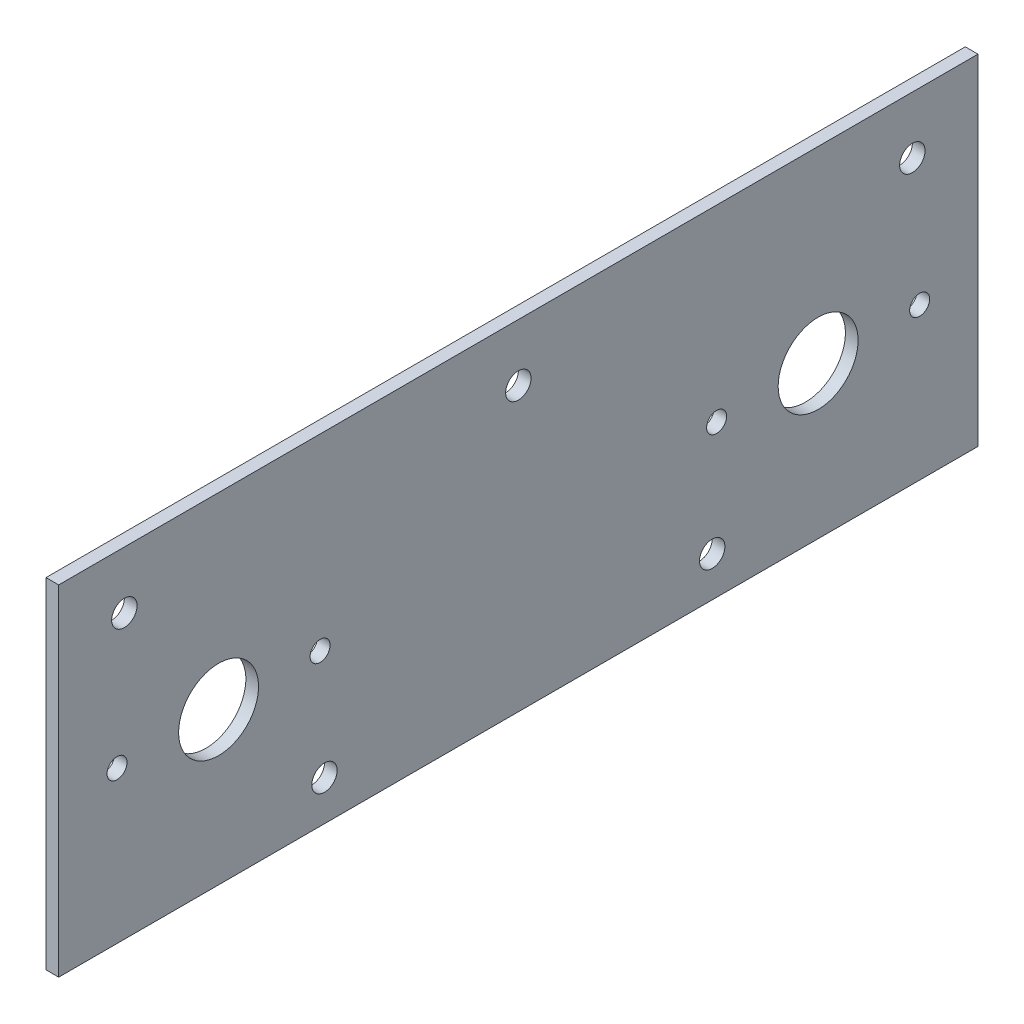
ISO-10303-21;
HEADER;
FILE_DESCRIPTION(('STEP AP214'),'2;1');
FILE_NAME('part.step','',(''),(''),'','','');
FILE_SCHEMA(('AUTOMOTIVE_DESIGN { 1 0 10303 214 1 1 1 1 }'));
ENDSEC;
DATA;
#1=APPLICATION_CONTEXT('core data for automotive mechanical design processes');
#2=APPLICATION_PROTOCOL_DEFINITION('international standard','automotive_design',2000,#1);
#3=PRODUCT_CONTEXT('',#1,'mechanical');
#4=PRODUCT('Part','Part','',(#3));
#5=PRODUCT_RELATED_PRODUCT_CATEGORY('part','',(#4));
#6=PRODUCT_DEFINITION_FORMATION('','',#4);
#7=PRODUCT_DEFINITION_CONTEXT('part definition',#1,'design');
#8=PRODUCT_DEFINITION('design','',#6,#7);
#9=PRODUCT_DEFINITION_SHAPE('','',#8);
#10=(LENGTH_UNIT() NAMED_UNIT(*) SI_UNIT(.MILLI.,.METRE.));
#11=(NAMED_UNIT(*) PLANE_ANGLE_UNIT() SI_UNIT($,.RADIAN.));
#12=(NAMED_UNIT(*) SI_UNIT($,.STERADIAN.) SOLID_ANGLE_UNIT());
#13=UNCERTAINTY_MEASURE_WITH_UNIT(LENGTH_MEASURE(1.E-05),#10,'distance_accuracy_value','');
#14=(GEOMETRIC_REPRESENTATION_CONTEXT(3) GLOBAL_UNCERTAINTY_ASSIGNED_CONTEXT((#13)) GLOBAL_UNIT_ASSIGNED_CONTEXT((#10,
#11,#12)) REPRESENTATION_CONTEXT('',''));
#15=CARTESIAN_POINT('',(0.,0.,0.));
#16=DIRECTION('',(0.,0.,1.));
#17=DIRECTION('',(1.,0.,0.));
#18=AXIS2_PLACEMENT_3D('',#15,#16,#17);
#19=CARTESIAN_POINT('',(0.,0.,0.));
#20=DIRECTION('',(1.,0.,0.));
#21=DIRECTION('',(0.,0.,-1.));
#22=AXIS2_PLACEMENT_3D('',#19,#20,#21);
#23=PLANE('',#22);
#24=CARTESIAN_POINT('',(0.,-4.49999999999999,-75.));
#25=DIRECTION('',(-1.,0.,0.));
#26=DIRECTION('',(0.,0.,1.));
#27=AXIS2_PLACEMENT_3D('',#24,#25,#26);
#28=CIRCLE('',#27,9.99999999999999);
#29=CARTESIAN_POINT('',(0.,-4.49999999999999,-65.));
#30=VERTEX_POINT('',#29);
#31=EDGE_CURVE('E112',#30,#30,#28,.F.);
#32=ORIENTED_EDGE('',*,*,#31,.T.);
#33=EDGE_LOOP('',(#32));
#34=FACE_BOUND('',#33,.T.);
#35=CARTESIAN_POINT('',(0.,-4.49999999999999,75.));
#36=DIRECTION('',(-1.,0.,0.));
#37=DIRECTION('',(0.,0.,1.));
#38=AXIS2_PLACEMENT_3D('',#35,#36,#37);
#39=CIRCLE('',#38,10.);
#40=CARTESIAN_POINT('',(0.,-4.49999999999999,85.));
#41=VERTEX_POINT('',#40);
#42=EDGE_CURVE('E116',#41,#41,#39,.F.);
#43=ORIENTED_EDGE('',*,*,#42,.T.);
#44=EDGE_LOOP('',(#43));
#45=FACE_BOUND('',#44,.T.);
#46=CARTESIAN_POINT('',(0.,-4.49999999999999,49.6));
#47=DIRECTION('',(-1.,0.,0.));
#48=DIRECTION('',(0.,0.,1.));
#49=AXIS2_PLACEMENT_3D('',#46,#47,#48);
#50=CIRCLE('',#49,2.5);
#51=CARTESIAN_POINT('',(0.,-4.49999999999999,52.1));
#52=VERTEX_POINT('',#51);
#53=EDGE_CURVE('E119',#52,#52,#50,.F.);
#54=ORIENTED_EDGE('',*,*,#53,.T.);
#55=EDGE_LOOP('',(#54));
#56=FACE_BOUND('',#55,.T.);
#57=CARTESIAN_POINT('',(0.,-4.49999999999999,-100.4));
#58=DIRECTION('',(-1.,0.,0.));
#59=DIRECTION('',(0.,0.,1.));
#60=AXIS2_PLACEMENT_3D('',#57,#58,#59);
#61=CIRCLE('',#60,2.5);
#62=CARTESIAN_POINT('',(0.,-4.49999999999999,-97.9));
#63=VERTEX_POINT('',#62);
#64=EDGE_CURVE('E122',#63,#63,#61,.F.);
#65=ORIENTED_EDGE('',*,*,#64,.T.);
#66=EDGE_LOOP('',(#65));
#67=FACE_BOUND('',#66,.T.);
#68=CARTESIAN_POINT('',(0.,-4.49999999999999,100.4));
#69=DIRECTION('',(-1.,0.,0.));
#70=DIRECTION('',(0.,0.,1.));
#71=AXIS2_PLACEMENT_3D('',#68,#69,#70);
#72=CIRCLE('',#71,2.5);
#73=CARTESIAN_POINT('',(0.,-4.49999999999999,102.9));
#74=VERTEX_POINT('',#73);
#75=EDGE_CURVE('E125',#74,#74,#72,.F.);
#76=ORIENTED_EDGE('',*,*,#75,.T.);
#77=EDGE_LOOP('',(#76));
#78=FACE_BOUND('',#77,.T.);
#79=CARTESIAN_POINT('',(0.,-4.49999999999999,-49.6));
#80=DIRECTION('',(-1.,0.,0.));
#81=DIRECTION('',(0.,0.,1.));
#82=AXIS2_PLACEMENT_3D('',#79,#80,#81);
#83=CIRCLE('',#82,2.5);
#84=CARTESIAN_POINT('',(0.,-4.49999999999999,-47.1));
#85=VERTEX_POINT('',#84);
#86=EDGE_CURVE('E128',#85,#85,#83,.F.);
#87=ORIENTED_EDGE('',*,*,#86,.T.);
#88=EDGE_LOOP('',(#87));
#89=FACE_BOUND('',#88,.T.);
#90=CARTESIAN_POINT('',(0.,28.212,98.571));
#91=DIRECTION('',(-1.,0.,0.));
#92=DIRECTION('',(0.,0.,1.));
#93=AXIS2_PLACEMENT_3D('',#90,#91,#92);
#94=CIRCLE('',#93,3.17499999999999);
#95=CARTESIAN_POINT('',(0.,28.212,101.746));
#96=VERTEX_POINT('',#95);
#97=EDGE_CURVE('E131',#96,#96,#94,.F.);
#98=ORIENTED_EDGE('',*,*,#97,.T.);
#99=EDGE_LOOP('',(#98));
#100=FACE_BOUND('',#99,.T.);
#101=CARTESIAN_POINT('',(0.,28.212,0.));
#102=DIRECTION('',(-1.,0.,0.));
#103=DIRECTION('',(0.,0.,1.));
#104=AXIS2_PLACEMENT_3D('',#101,#102,#103);
#105=CIRCLE('',#104,3.175);
#106=CARTESIAN_POINT('',(0.,28.212,3.175));
#107=VERTEX_POINT('',#106);
#108=EDGE_CURVE('E134',#107,#107,#105,.F.);
#109=ORIENTED_EDGE('',*,*,#108,.T.);
#110=EDGE_LOOP('',(#109));
#111=FACE_BOUND('',#110,.T.);
#112=CARTESIAN_POINT('',(0.,28.212,-98.571));
#113=DIRECTION('',(-1.,0.,0.));
#114=DIRECTION('',(0.,0.,1.));
#115=AXIS2_PLACEMENT_3D('',#112,#113,#114);
#116=CIRCLE('',#115,3.17499999999999);
#117=CARTESIAN_POINT('',(0.,28.212,-95.396));
#118=VERTEX_POINT('',#117);
#119=EDGE_CURVE('E137',#118,#118,#116,.F.);
#120=ORIENTED_EDGE('',*,*,#119,.T.);
#121=EDGE_LOOP('',(#120));
#122=FACE_BOUND('',#121,.T.);
#123=CARTESIAN_POINT('',(0.,-32.5,48.5));
#124=DIRECTION('',(-1.,0.,0.));
#125=DIRECTION('',(0.,0.,1.));
#126=AXIS2_PLACEMENT_3D('',#123,#124,#125);
#127=CIRCLE('',#126,3.175);
#128=CARTESIAN_POINT('',(0.,-32.5,51.675));
#129=VERTEX_POINT('',#128);
#130=EDGE_CURVE('E139',#129,#129,#127,.F.);
#131=ORIENTED_EDGE('',*,*,#130,.T.);
#132=EDGE_LOOP('',(#131));
#133=FACE_BOUND('',#132,.T.);
#134=CARTESIAN_POINT('',(0.,-32.5,-48.5));
#135=DIRECTION('',(-1.,0.,0.));
#136=DIRECTION('',(0.,0.,1.));
#137=AXIS2_PLACEMENT_3D('',#134,#135,#136);
#138=CIRCLE('',#137,3.175);
#139=CARTESIAN_POINT('',(0.,-32.5,-45.325));
#140=VERTEX_POINT('',#139);
#141=EDGE_CURVE('E20',#140,#140,#138,.F.);
#142=ORIENTED_EDGE('',*,*,#141,.T.);
#143=EDGE_LOOP('',(#142));
#144=FACE_BOUND('',#143,.T.);
#145=DIRECTION('',(0.,0.,1.));
#146=VECTOR('',#145,1.);
#147=CARTESIAN_POINT('',(0.,42.5,-115.));
#148=LINE('',#147,#146);
#149=CARTESIAN_POINT('',(0.,42.5,-115.));
#150=VERTEX_POINT('',#149);
#151=CARTESIAN_POINT('',(0.,42.5,115.));
#152=VERTEX_POINT('',#151);
#153=EDGE_CURVE('E148',#150,#152,#148,.T.);
#154=ORIENTED_EDGE('',*,*,#153,.F.);
#155=DIRECTION('',(0.,1.,0.));
#156=VECTOR('',#155,1.);
#157=CARTESIAN_POINT('',(0.,-42.5,-115.));
#158=LINE('',#157,#156);
#159=CARTESIAN_POINT('',(0.,-42.5,-115.));
#160=VERTEX_POINT('',#159);
#161=EDGE_CURVE('E55',#160,#150,#158,.T.);
#162=ORIENTED_EDGE('',*,*,#161,.F.);
#163=DIRECTION('',(0.,0.,-1.));
#164=VECTOR('',#163,1.);
#165=CARTESIAN_POINT('',(0.,-42.5,115.));
#166=LINE('',#165,#164);
#167=CARTESIAN_POINT('',(0.,-42.5,115.));
#168=VERTEX_POINT('',#167);
#169=EDGE_CURVE('E57',#168,#160,#166,.T.);
#170=ORIENTED_EDGE('',*,*,#169,.F.);
#171=DIRECTION('',(0.,1.,0.));
#172=VECTOR('',#171,1.);
#173=CARTESIAN_POINT('',(0.,42.5,115.));
#174=LINE('',#173,#172);
#175=EDGE_CURVE('E59',#152,#168,#174,.F.);
#176=ORIENTED_EDGE('',*,*,#175,.F.);
#177=EDGE_LOOP('',(#154,#162,#170,#176));
#178=FACE_BOUND('',#177,.T.);
#179=ADVANCED_FACE('F17',(#34,#45,#56,#67,#78,#89,#100,#111,#122,#133,#144,#178),#23,.F.);
#180=CARTESIAN_POINT('',(0.,42.5,115.));
#181=DIRECTION('',(0.,0.,1.));
#182=DIRECTION('',(1.,0.,0.));
#183=AXIS2_PLACEMENT_3D('',#180,#181,#182);
#184=PLANE('',#183);
#185=DIRECTION('',(0.,1.,0.));
#186=VECTOR('',#185,1.);
#187=CARTESIAN_POINT('',(3.175,0.,115.));
#188=LINE('',#187,#186);
#189=CARTESIAN_POINT('',(3.175,42.5,115.));
#190=VERTEX_POINT('',#189);
#191=CARTESIAN_POINT('',(3.175,-42.5,115.));
#192=VERTEX_POINT('',#191);
#193=EDGE_CURVE('E115',#190,#192,#188,.F.);
#194=ORIENTED_EDGE('',*,*,#193,.F.);
#195=DIRECTION('',(1.,0.,0.));
#196=VECTOR('',#195,1.);
#197=CARTESIAN_POINT('',(0.,42.5,115.));
#198=LINE('',#197,#196);
#199=EDGE_CURVE('E70',#152,#190,#198,.T.);
#200=ORIENTED_EDGE('',*,*,#199,.F.);
#201=ORIENTED_EDGE('',*,*,#175,.T.);
#202=DIRECTION('',(1.,0.,0.));
#203=VECTOR('',#202,1.);
#204=CARTESIAN_POINT('',(0.,-42.5,115.));
#205=LINE('',#204,#203);
#206=EDGE_CURVE('E64',#192,#168,#205,.F.);
#207=ORIENTED_EDGE('',*,*,#206,.F.);
#208=EDGE_LOOP('',(#194,#200,#201,#207));
#209=FACE_BOUND('',#208,.T.);
#210=ADVANCED_FACE('F67',(#209),#184,.T.);
#211=CARTESIAN_POINT('',(0.,-42.5,115.));
#212=DIRECTION('',(0.,-1.,0.));
#213=DIRECTION('',(0.,0.,-1.));
#214=AXIS2_PLACEMENT_3D('',#211,#212,#213);
#215=PLANE('',#214);
#216=DIRECTION('',(0.,0.,-1.));
#217=VECTOR('',#216,1.);
#218=CARTESIAN_POINT('',(3.175,-42.5,0.));
#219=LINE('',#218,#217);
#220=CARTESIAN_POINT('',(3.175,-42.5,-115.));
#221=VERTEX_POINT('',#220);
#222=EDGE_CURVE('E75',#192,#221,#219,.T.);
#223=ORIENTED_EDGE('',*,*,#222,.F.);
#224=ORIENTED_EDGE('',*,*,#206,.T.);
#225=ORIENTED_EDGE('',*,*,#169,.T.);
#226=DIRECTION('',(-1.,0.,0.));
#227=VECTOR('',#226,1.);
#228=CARTESIAN_POINT('',(0.,-42.5,-115.));
#229=LINE('',#228,#227);
#230=EDGE_CURVE('E78',#221,#160,#229,.T.);
#231=ORIENTED_EDGE('',*,*,#230,.F.);
#232=EDGE_LOOP('',(#223,#224,#225,#231));
#233=FACE_BOUND('',#232,.T.);
#234=ADVANCED_FACE('F73',(#233),#215,.T.);
#235=CARTESIAN_POINT('',(0.,-42.5,-115.));
#236=DIRECTION('',(0.,0.,-1.));
#237=DIRECTION('',(-1.,0.,0.));
#238=AXIS2_PLACEMENT_3D('',#235,#236,#237);
#239=PLANE('',#238);
#240=DIRECTION('',(0.,1.,0.));
#241=VECTOR('',#240,1.);
#242=CARTESIAN_POINT('',(3.175,0.,-115.));
#243=LINE('',#242,#241);
#244=CARTESIAN_POINT('',(3.175,42.5,-115.));
#245=VERTEX_POINT('',#244);
#246=EDGE_CURVE('E155',#221,#245,#243,.T.);
#247=ORIENTED_EDGE('',*,*,#246,.F.);
#248=ORIENTED_EDGE('',*,*,#230,.T.);
#249=ORIENTED_EDGE('',*,*,#161,.T.);
#250=DIRECTION('',(1.,0.,0.));
#251=VECTOR('',#250,1.);
#252=CARTESIAN_POINT('',(0.,42.5,-115.));
#253=LINE('',#252,#251);
#254=EDGE_CURVE('E35',#245,#150,#253,.F.);
#255=ORIENTED_EDGE('',*,*,#254,.F.);
#256=EDGE_LOOP('',(#247,#248,#249,#255));
#257=FACE_BOUND('',#256,.T.);
#258=ADVANCED_FACE('F153',(#257),#239,.T.);
#259=CARTESIAN_POINT('',(0.,42.5,-115.));
#260=DIRECTION('',(0.,1.,0.));
#261=DIRECTION('',(0.,0.,1.));
#262=AXIS2_PLACEMENT_3D('',#259,#260,#261);
#263=PLANE('',#262);
#264=DIRECTION('',(0.,0.,-1.));
#265=VECTOR('',#264,1.);
#266=CARTESIAN_POINT('',(3.175,42.5,0.));
#267=LINE('',#266,#265);
#268=EDGE_CURVE('E111',#245,#190,#267,.F.);
#269=ORIENTED_EDGE('',*,*,#268,.F.);
#270=ORIENTED_EDGE('',*,*,#254,.T.);
#271=ORIENTED_EDGE('',*,*,#153,.T.);
#272=ORIENTED_EDGE('',*,*,#199,.T.);
#273=EDGE_LOOP('',(#269,#270,#271,#272));
#274=FACE_BOUND('',#273,.T.);
#275=ADVANCED_FACE('F161',(#274),#263,.T.);
#276=CARTESIAN_POINT('',(3.175,-32.5,-48.5));
#277=DIRECTION('',(-1.,0.,0.));
#278=DIRECTION('',(0.,0.,1.));
#279=AXIS2_PLACEMENT_3D('',#276,#277,#278);
#280=CYLINDRICAL_SURFACE('',#279,3.175);
#281=ORIENTED_EDGE('',*,*,#141,.F.);
#282=EDGE_LOOP('',(#281));
#283=FACE_BOUND('',#282,.T.);
#284=CARTESIAN_POINT('',(3.175,-32.5,-48.5));
#285=DIRECTION('',(-1.,0.,0.));
#286=DIRECTION('',(0.,0.,1.));
#287=AXIS2_PLACEMENT_3D('',#284,#285,#286);
#288=CIRCLE('',#287,3.175);
#289=CARTESIAN_POINT('',(3.175,-32.5,-45.325));
#290=VERTEX_POINT('',#289);
#291=EDGE_CURVE('E108',#290,#290,#288,.T.);
#292=ORIENTED_EDGE('',*,*,#291,.F.);
#293=EDGE_LOOP('',(#292));
#294=FACE_BOUND('',#293,.T.);
#295=ADVANCED_FACE('F163',(#283,#294),#280,.F.);
#296=CARTESIAN_POINT('',(3.175,-32.5,48.5));
#297=DIRECTION('',(-1.,0.,0.));
#298=DIRECTION('',(0.,0.,1.));
#299=AXIS2_PLACEMENT_3D('',#296,#297,#298);
#300=CYLINDRICAL_SURFACE('',#299,3.175);
#301=ORIENTED_EDGE('',*,*,#130,.F.);
#302=EDGE_LOOP('',(#301));
#303=FACE_BOUND('',#302,.T.);
#304=CARTESIAN_POINT('',(3.175,-32.5,48.5));
#305=DIRECTION('',(-1.,0.,0.));
#306=DIRECTION('',(0.,0.,1.));
#307=AXIS2_PLACEMENT_3D('',#304,#305,#306);
#308=CIRCLE('',#307,3.175);
#309=CARTESIAN_POINT('',(3.175,-32.5,51.675));
#310=VERTEX_POINT('',#309);
#311=EDGE_CURVE('E105',#310,#310,#308,.T.);
#312=ORIENTED_EDGE('',*,*,#311,.F.);
#313=EDGE_LOOP('',(#312));
#314=FACE_BOUND('',#313,.T.);
#315=ADVANCED_FACE('F170',(#303,#314),#300,.F.);
#316=CARTESIAN_POINT('',(3.175,28.212,-98.571));
#317=DIRECTION('',(-1.,0.,0.));
#318=DIRECTION('',(0.,0.,1.));
#319=AXIS2_PLACEMENT_3D('',#316,#317,#318);
#320=CYLINDRICAL_SURFACE('',#319,3.17499999999999);
#321=ORIENTED_EDGE('',*,*,#119,.F.);
#322=EDGE_LOOP('',(#321));
#323=FACE_BOUND('',#322,.T.);
#324=CARTESIAN_POINT('',(3.175,28.212,-98.571));
#325=DIRECTION('',(-1.,0.,0.));
#326=DIRECTION('',(0.,0.,1.));
#327=AXIS2_PLACEMENT_3D('',#324,#325,#326);
#328=CIRCLE('',#327,3.17499999999999);
#329=CARTESIAN_POINT('',(3.175,28.212,-95.396));
#330=VERTEX_POINT('',#329);
#331=EDGE_CURVE('E102',#330,#330,#328,.T.);
#332=ORIENTED_EDGE('',*,*,#331,.F.);
#333=EDGE_LOOP('',(#332));
#334=FACE_BOUND('',#333,.T.);
#335=ADVANCED_FACE('F212',(#323,#334),#320,.F.);
#336=CARTESIAN_POINT('',(3.175,28.212,0.));
#337=DIRECTION('',(-1.,0.,0.));
#338=DIRECTION('',(0.,0.,1.));
#339=AXIS2_PLACEMENT_3D('',#336,#337,#338);
#340=CYLINDRICAL_SURFACE('',#339,3.175);
#341=ORIENTED_EDGE('',*,*,#108,.F.);
#342=EDGE_LOOP('',(#341));
#343=FACE_BOUND('',#342,.T.);
#344=CARTESIAN_POINT('',(3.175,28.212,0.));
#345=DIRECTION('',(-1.,0.,0.));
#346=DIRECTION('',(0.,0.,1.));
#347=AXIS2_PLACEMENT_3D('',#344,#345,#346);
#348=CIRCLE('',#347,3.175);
#349=CARTESIAN_POINT('',(3.175,28.212,3.175));
#350=VERTEX_POINT('',#349);
#351=EDGE_CURVE('E99',#350,#350,#348,.T.);
#352=ORIENTED_EDGE('',*,*,#351,.F.);
#353=EDGE_LOOP('',(#352));
#354=FACE_BOUND('',#353,.T.);
#355=ADVANCED_FACE('F208',(#343,#354),#340,.F.);
#356=CARTESIAN_POINT('',(3.175,28.212,98.571));
#357=DIRECTION('',(-1.,0.,0.));
#358=DIRECTION('',(0.,0.,1.));
#359=AXIS2_PLACEMENT_3D('',#356,#357,#358);
#360=CYLINDRICAL_SURFACE('',#359,3.17499999999999);
#361=ORIENTED_EDGE('',*,*,#97,.F.);
#362=EDGE_LOOP('',(#361));
#363=FACE_BOUND('',#362,.T.);
#364=CARTESIAN_POINT('',(3.175,28.212,98.571));
#365=DIRECTION('',(-1.,0.,0.));
#366=DIRECTION('',(0.,0.,1.));
#367=AXIS2_PLACEMENT_3D('',#364,#365,#366);
#368=CIRCLE('',#367,3.17499999999999);
#369=CARTESIAN_POINT('',(3.175,28.212,101.746));
#370=VERTEX_POINT('',#369);
#371=EDGE_CURVE('E96',#370,#370,#368,.T.);
#372=ORIENTED_EDGE('',*,*,#371,.F.);
#373=EDGE_LOOP('',(#372));
#374=FACE_BOUND('',#373,.T.);
#375=ADVANCED_FACE('F204',(#363,#374),#360,.F.);
#376=CARTESIAN_POINT('',(3.175,-4.49999999999999,-49.6));
#377=DIRECTION('',(-1.,0.,0.));
#378=DIRECTION('',(0.,0.,1.));
#379=AXIS2_PLACEMENT_3D('',#376,#377,#378);
#380=CYLINDRICAL_SURFACE('',#379,2.5);
#381=ORIENTED_EDGE('',*,*,#86,.F.);
#382=EDGE_LOOP('',(#381));
#383=FACE_BOUND('',#382,.T.);
#384=CARTESIAN_POINT('',(3.175,-4.49999999999999,-49.6));
#385=DIRECTION('',(-1.,0.,0.));
#386=DIRECTION('',(0.,0.,1.));
#387=AXIS2_PLACEMENT_3D('',#384,#385,#386);
#388=CIRCLE('',#387,2.5);
#389=CARTESIAN_POINT('',(3.175,-4.49999999999999,-47.1));
#390=VERTEX_POINT('',#389);
#391=EDGE_CURVE('E93',#390,#390,#388,.T.);
#392=ORIENTED_EDGE('',*,*,#391,.F.);
#393=EDGE_LOOP('',(#392));
#394=FACE_BOUND('',#393,.T.);
#395=ADVANCED_FACE('F200',(#383,#394),#380,.F.);
#396=CARTESIAN_POINT('',(3.175,-4.49999999999999,100.4));
#397=DIRECTION('',(-1.,0.,0.));
#398=DIRECTION('',(0.,0.,1.));
#399=AXIS2_PLACEMENT_3D('',#396,#397,#398);
#400=CYLINDRICAL_SURFACE('',#399,2.5);
#401=ORIENTED_EDGE('',*,*,#75,.F.);
#402=EDGE_LOOP('',(#401));
#403=FACE_BOUND('',#402,.T.);
#404=CARTESIAN_POINT('',(3.175,-4.49999999999999,100.4));
#405=DIRECTION('',(-1.,0.,0.));
#406=DIRECTION('',(0.,0.,1.));
#407=AXIS2_PLACEMENT_3D('',#404,#405,#406);
#408=CIRCLE('',#407,2.5);
#409=CARTESIAN_POINT('',(3.175,-4.49999999999999,102.9));
#410=VERTEX_POINT('',#409);
#411=EDGE_CURVE('E90',#410,#410,#408,.T.);
#412=ORIENTED_EDGE('',*,*,#411,.F.);
#413=EDGE_LOOP('',(#412));
#414=FACE_BOUND('',#413,.T.);
#415=ADVANCED_FACE('F196',(#403,#414),#400,.F.);
#416=CARTESIAN_POINT('',(3.175,-4.49999999999999,-100.4));
#417=DIRECTION('',(-1.,0.,0.));
#418=DIRECTION('',(0.,0.,1.));
#419=AXIS2_PLACEMENT_3D('',#416,#417,#418);
#420=CYLINDRICAL_SURFACE('',#419,2.5);
#421=ORIENTED_EDGE('',*,*,#64,.F.);
#422=EDGE_LOOP('',(#421));
#423=FACE_BOUND('',#422,.T.);
#424=CARTESIAN_POINT('',(3.175,-4.49999999999999,-100.4));
#425=DIRECTION('',(-1.,0.,0.));
#426=DIRECTION('',(0.,0.,1.));
#427=AXIS2_PLACEMENT_3D('',#424,#425,#426);
#428=CIRCLE('',#427,2.5);
#429=CARTESIAN_POINT('',(3.175,-4.49999999999999,-97.9));
#430=VERTEX_POINT('',#429);
#431=EDGE_CURVE('E87',#430,#430,#428,.T.);
#432=ORIENTED_EDGE('',*,*,#431,.F.);
#433=EDGE_LOOP('',(#432));
#434=FACE_BOUND('',#433,.T.);
#435=ADVANCED_FACE('F192',(#423,#434),#420,.F.);
#436=CARTESIAN_POINT('',(3.175,-4.49999999999999,49.6));
#437=DIRECTION('',(-1.,0.,0.));
#438=DIRECTION('',(0.,0.,1.));
#439=AXIS2_PLACEMENT_3D('',#436,#437,#438);
#440=CYLINDRICAL_SURFACE('',#439,2.5);
#441=ORIENTED_EDGE('',*,*,#53,.F.);
#442=EDGE_LOOP('',(#441));
#443=FACE_BOUND('',#442,.T.);
#444=CARTESIAN_POINT('',(3.175,-4.49999999999999,49.6));
#445=DIRECTION('',(-1.,0.,0.));
#446=DIRECTION('',(0.,0.,1.));
#447=AXIS2_PLACEMENT_3D('',#444,#445,#446);
#448=CIRCLE('',#447,2.5);
#449=CARTESIAN_POINT('',(3.175,-4.49999999999999,52.1));
#450=VERTEX_POINT('',#449);
#451=EDGE_CURVE('E84',#450,#450,#448,.T.);
#452=ORIENTED_EDGE('',*,*,#451,.F.);
#453=EDGE_LOOP('',(#452));
#454=FACE_BOUND('',#453,.T.);
#455=ADVANCED_FACE('F188',(#443,#454),#440,.F.);
#456=CARTESIAN_POINT('',(3.175,-4.49999999999999,75.));
#457=DIRECTION('',(-1.,0.,0.));
#458=DIRECTION('',(0.,0.,1.));
#459=AXIS2_PLACEMENT_3D('',#456,#457,#458);
#460=CYLINDRICAL_SURFACE('',#459,10.);
#461=ORIENTED_EDGE('',*,*,#42,.F.);
#462=EDGE_LOOP('',(#461));
#463=FACE_BOUND('',#462,.T.);
#464=CARTESIAN_POINT('',(3.175,-4.49999999999999,75.));
#465=DIRECTION('',(-1.,0.,0.));
#466=DIRECTION('',(0.,0.,1.));
#467=AXIS2_PLACEMENT_3D('',#464,#465,#466);
#468=CIRCLE('',#467,10.);
#469=CARTESIAN_POINT('',(3.175,-4.49999999999999,85.));
#470=VERTEX_POINT('',#469);
#471=EDGE_CURVE('E26',#470,#470,#468,.T.);
#472=ORIENTED_EDGE('',*,*,#471,.F.);
#473=EDGE_LOOP('',(#472));
#474=FACE_BOUND('',#473,.T.);
#475=ADVANCED_FACE('F181',(#463,#474),#460,.F.);
#476=CARTESIAN_POINT('',(3.175,-4.49999999999999,-75.));
#477=DIRECTION('',(-1.,0.,0.));
#478=DIRECTION('',(0.,0.,1.));
#479=AXIS2_PLACEMENT_3D('',#476,#477,#478);
#480=CYLINDRICAL_SURFACE('',#479,9.99999999999999);
#481=ORIENTED_EDGE('',*,*,#31,.F.);
#482=EDGE_LOOP('',(#481));
#483=FACE_BOUND('',#482,.T.);
#484=CARTESIAN_POINT('',(3.175,-4.49999999999999,-75.));
#485=DIRECTION('',(-1.,0.,0.));
#486=DIRECTION('',(0.,0.,1.));
#487=AXIS2_PLACEMENT_3D('',#484,#485,#486);
#488=CIRCLE('',#487,9.99999999999999);
#489=CARTESIAN_POINT('',(3.175,-4.49999999999999,-65.));
#490=VERTEX_POINT('',#489);
#491=EDGE_CURVE('E11',#490,#490,#488,.T.);
#492=ORIENTED_EDGE('',*,*,#491,.F.);
#493=EDGE_LOOP('',(#492));
#494=FACE_BOUND('',#493,.T.);
#495=ADVANCED_FACE('F175',(#483,#494),#480,.F.);
#496=CARTESIAN_POINT('',(3.175,0.,0.));
#497=DIRECTION('',(1.,0.,0.));
#498=DIRECTION('',(0.,0.,-1.));
#499=AXIS2_PLACEMENT_3D('',#496,#497,#498);
#500=PLANE('',#499);
#501=ORIENTED_EDGE('',*,*,#491,.T.);
#502=EDGE_LOOP('',(#501));
#503=FACE_BOUND('',#502,.T.);
#504=ORIENTED_EDGE('',*,*,#471,.T.);
#505=EDGE_LOOP('',(#504));
#506=FACE_BOUND('',#505,.T.);
#507=ORIENTED_EDGE('',*,*,#451,.T.);
#508=EDGE_LOOP('',(#507));
#509=FACE_BOUND('',#508,.T.);
#510=ORIENTED_EDGE('',*,*,#431,.T.);
#511=EDGE_LOOP('',(#510));
#512=FACE_BOUND('',#511,.T.);
#513=ORIENTED_EDGE('',*,*,#411,.T.);
#514=EDGE_LOOP('',(#513));
#515=FACE_BOUND('',#514,.T.);
#516=ORIENTED_EDGE('',*,*,#391,.T.);
#517=EDGE_LOOP('',(#516));
#518=FACE_BOUND('',#517,.T.);
#519=ORIENTED_EDGE('',*,*,#371,.T.);
#520=EDGE_LOOP('',(#519));
#521=FACE_BOUND('',#520,.T.);
#522=ORIENTED_EDGE('',*,*,#351,.T.);
#523=EDGE_LOOP('',(#522));
#524=FACE_BOUND('',#523,.T.);
#525=ORIENTED_EDGE('',*,*,#331,.T.);
#526=EDGE_LOOP('',(#525));
#527=FACE_BOUND('',#526,.T.);
#528=ORIENTED_EDGE('',*,*,#311,.T.);
#529=EDGE_LOOP('',(#528));
#530=FACE_BOUND('',#529,.T.);
#531=ORIENTED_EDGE('',*,*,#291,.T.);
#532=EDGE_LOOP('',(#531));
#533=FACE_BOUND('',#532,.T.);
#534=ORIENTED_EDGE('',*,*,#246,.T.);
#535=ORIENTED_EDGE('',*,*,#268,.T.);
#536=ORIENTED_EDGE('',*,*,#193,.T.);
#537=ORIENTED_EDGE('',*,*,#222,.T.);
#538=EDGE_LOOP('',(#534,#535,#536,#537));
#539=FACE_BOUND('',#538,.T.);
#540=ADVANCED_FACE('F159',(#503,#506,#509,#512,#515,#518,#521,#524,#527,#530,#533,#539),#500,.T.);
#541=CLOSED_SHELL('',(#179,#210,#234,#258,#275,#295,#315,#335,#355,#375,#395,#415,#435,#455,
#475,#495,#540));
#542=MANIFOLD_SOLID_BREP('B1',#541);
#543=ADVANCED_BREP_SHAPE_REPRESENTATION('',(#18,#542),#14);
#544=SHAPE_DEFINITION_REPRESENTATION(#9,#543);
ENDSEC;
END-ISO-10303-21;
